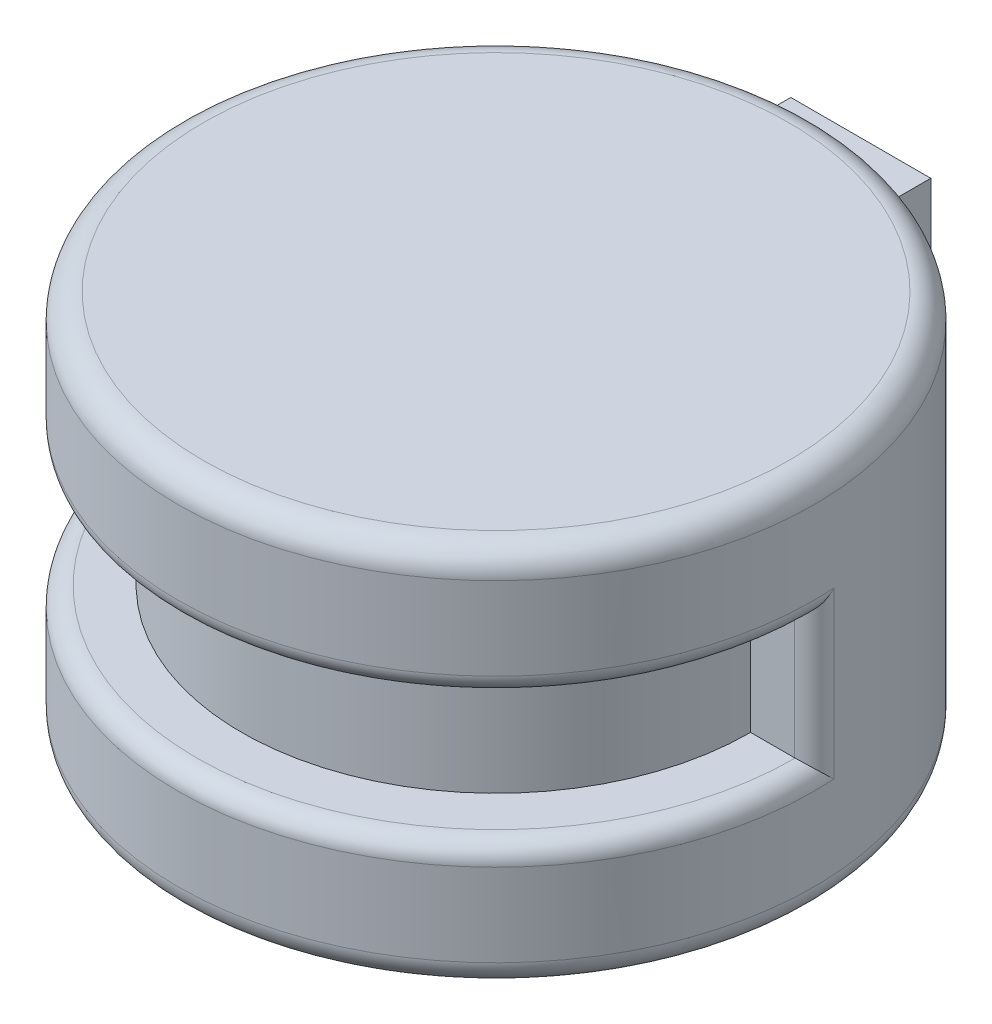
ISO-10303-21;
HEADER;
FILE_DESCRIPTION(('STEP AP214'),'2;1');
FILE_NAME('part.step','',(''),(''),'','','');
FILE_SCHEMA(('AUTOMOTIVE_DESIGN { 1 0 10303 214 1 1 1 1 }'));
ENDSEC;
DATA;
#1=APPLICATION_CONTEXT('core data for automotive mechanical design processes');
#2=APPLICATION_PROTOCOL_DEFINITION('international standard','automotive_design',2000,#1);
#3=PRODUCT_CONTEXT('',#1,'mechanical');
#4=PRODUCT('Part','Part','',(#3));
#5=PRODUCT_RELATED_PRODUCT_CATEGORY('part','',(#4));
#6=PRODUCT_DEFINITION_FORMATION('','',#4);
#7=PRODUCT_DEFINITION_CONTEXT('part definition',#1,'design');
#8=PRODUCT_DEFINITION('design','',#6,#7);
#9=PRODUCT_DEFINITION_SHAPE('','',#8);
#10=(LENGTH_UNIT() NAMED_UNIT(*) SI_UNIT(.MILLI.,.METRE.));
#11=(NAMED_UNIT(*) PLANE_ANGLE_UNIT() SI_UNIT($,.RADIAN.));
#12=(NAMED_UNIT(*) SI_UNIT($,.STERADIAN.) SOLID_ANGLE_UNIT());
#13=UNCERTAINTY_MEASURE_WITH_UNIT(LENGTH_MEASURE(1.E-05),#10,'distance_accuracy_value','');
#14=(GEOMETRIC_REPRESENTATION_CONTEXT(3) GLOBAL_UNCERTAINTY_ASSIGNED_CONTEXT((#13)) GLOBAL_UNIT_ASSIGNED_CONTEXT((#10,
#11,#12)) REPRESENTATION_CONTEXT('',''));
#15=CARTESIAN_POINT('',(0.,0.,0.));
#16=DIRECTION('',(0.,0.,1.));
#17=DIRECTION('',(1.,0.,0.));
#18=AXIS2_PLACEMENT_3D('',#15,#16,#17);
#19=CARTESIAN_POINT('',(0.00144141468197306,-38.9399020394753,-1.53515637649188));
#20=DIRECTION('',(0.,1.,0.));
#21=DIRECTION('',(0.,0.,1.));
#22=AXIS2_PLACEMENT_3D('',#19,#20,#21);
#23=CYLINDRICAL_SURFACE('',#22,15.);
#24=DIRECTION('',(0.,1.,0.));
#25=VECTOR('',#24,1.);
#26=CARTESIAN_POINT('',(-14.9679705847545,-38.9399020394753,-2.49260318500251));
#27=LINE('',#26,#25);
#28=CARTESIAN_POINT('',(-14.9679705847545,-33.8399020394754,-2.49260318500251));
#29=VERTEX_POINT('',#28);
#30=CARTESIAN_POINT('',(-14.9679705847545,-26.0399020394754,-2.49260318500251));
#31=VERTEX_POINT('',#30);
#32=EDGE_CURVE('E199',#29,#31,#27,.T.);
#33=ORIENTED_EDGE('',*,*,#32,.T.);
#34=CARTESIAN_POINT('',(0.00144141468197306,-26.0399020394754,-1.53515637649188));
#35=DIRECTION('',(0.,1.,0.));
#36=DIRECTION('',(0.,0.,1.));
#37=AXIS2_PLACEMENT_3D('',#34,#35,#36);
#38=CIRCLE('',#37,15.);
#39=CARTESIAN_POINT('',(14.9708534141184,-26.0399020394754,-2.49260318500251));
#40=VERTEX_POINT('',#39);
#41=EDGE_CURVE('E202',#31,#40,#38,.T.);
#42=ORIENTED_EDGE('',*,*,#41,.T.);
#43=DIRECTION('',(0.,1.,0.));
#44=VECTOR('',#43,1.);
#45=CARTESIAN_POINT('',(14.9708534141184,-38.9399020394753,-2.49260318500251));
#46=LINE('',#45,#44);
#47=CARTESIAN_POINT('',(14.9708534141184,-33.8399020394754,-2.49260318500251));
#48=VERTEX_POINT('',#47);
#49=EDGE_CURVE('E197',#40,#48,#46,.F.);
#50=ORIENTED_EDGE('',*,*,#49,.T.);
#51=CARTESIAN_POINT('',(0.00144141468197306,-33.8399020394754,-1.53515637649188));
#52=DIRECTION('',(0.,1.,0.));
#53=DIRECTION('',(0.,0.,1.));
#54=AXIS2_PLACEMENT_3D('',#51,#52,#53);
#55=CIRCLE('',#54,15.);
#56=EDGE_CURVE('E195',#48,#29,#55,.F.);
#57=ORIENTED_EDGE('',*,*,#56,.T.);
#58=EDGE_LOOP('',(#33,#42,#50,#57));
#59=FACE_BOUND('',#58,.T.);
#60=CARTESIAN_POINT('',(0.00144141468197306,-22.1399020394753,-1.53515637649188));
#61=DIRECTION('',(0.,1.,0.));
#62=DIRECTION('',(0.,0.,1.));
#63=AXIS2_PLACEMENT_3D('',#60,#61,#62);
#64=CIRCLE('',#63,15.);
#65=CARTESIAN_POINT('',(0.00144141468197306,-22.1399020394753,13.4648436235081));
#66=VERTEX_POINT('',#65);
#67=EDGE_CURVE('E189',#66,#66,#64,.F.);
#68=ORIENTED_EDGE('',*,*,#67,.T.);
#69=EDGE_LOOP('',(#68));
#70=FACE_BOUND('',#69,.T.);
#71=CARTESIAN_POINT('',(0.00144141468197306,-37.7399020394753,-1.53515637649188));
#72=DIRECTION('',(0.,1.,0.));
#73=DIRECTION('',(0.,0.,1.));
#74=AXIS2_PLACEMENT_3D('',#71,#72,#73);
#75=CIRCLE('',#74,15.);
#76=CARTESIAN_POINT('',(0.00144141468197306,-37.7399020394753,13.4648436235081));
#77=VERTEX_POINT('',#76);
#78=EDGE_CURVE('E186',#77,#77,#75,.T.);
#79=ORIENTED_EDGE('',*,*,#78,.T.);
#80=EDGE_LOOP('',(#79));
#81=FACE_BOUND('',#80,.T.);
#82=CARTESIAN_POINT('',(0.00144141468197306,-23.1662413151324,-1.53515637649188));
#83=DIRECTION('',(0.,-1.,0.));
#84=DIRECTION('',(0.,0.,-1.));
#85=AXIS2_PLACEMENT_3D('',#82,#83,#84);
#86=CIRCLE('',#85,15.);
#87=CARTESIAN_POINT('',(3.39590080940108,-23.1662413151324,-16.1460305946077));
#88=VERTEX_POINT('',#87);
#89=CARTESIAN_POINT('',(-3.20409919059891,-23.1662413151324,-16.1886375133377));
#90=VERTEX_POINT('',#89);
#91=EDGE_CURVE('E134',#88,#90,#86,.F.);
#92=ORIENTED_EDGE('',*,*,#91,.T.);
#93=DIRECTION('',(0.,1.,0.));
#94=VECTOR('',#93,1.);
#95=CARTESIAN_POINT('',(-3.20409919059891,-38.9399020394753,-16.1886375133377));
#96=LINE('',#95,#94);
#97=CARTESIAN_POINT('',(-3.20409919059891,-27.9662413151324,-16.1886375133377));
#98=VERTEX_POINT('',#97);
#99=EDGE_CURVE('E11',#90,#98,#96,.F.);
#100=ORIENTED_EDGE('',*,*,#99,.T.);
#101=CARTESIAN_POINT('',(0.00144141468197306,-27.9662413151324,-1.53515637649188));
#102=DIRECTION('',(0.,1.,0.));
#103=DIRECTION('',(0.,0.,1.));
#104=AXIS2_PLACEMENT_3D('',#101,#102,#103);
#105=CIRCLE('',#104,15.);
#106=CARTESIAN_POINT('',(3.39590080940108,-27.9662413151324,-16.1460305946077));
#107=VERTEX_POINT('',#106);
#108=EDGE_CURVE('E221',#98,#107,#105,.F.);
#109=ORIENTED_EDGE('',*,*,#108,.T.);
#110=DIRECTION('',(0.,1.,0.));
#111=VECTOR('',#110,1.);
#112=CARTESIAN_POINT('',(3.39590080940108,-38.9399020394753,-16.1460305946077));
#113=LINE('',#112,#111);
#114=EDGE_CURVE('E48',#107,#88,#113,.T.);
#115=ORIENTED_EDGE('',*,*,#114,.T.);
#116=EDGE_LOOP('',(#92,#100,#109,#115));
#117=FACE_BOUND('',#116,.T.);
#118=ADVANCED_FACE('F39',(#59,#70,#81,#117),#23,.T.);
#119=CARTESIAN_POINT('',(0.00144141468197306,-38.9399020394753,-1.53515637649188));
#120=DIRECTION('',(0.,0.,-1.));
#121=DIRECTION('',(-1.,0.,0.));
#122=AXIS2_PLACEMENT_3D('',#119,#120,#121);
#123=PLANE('',#122);
#124=DIRECTION('',(-1.,0.,0.));
#125=VECTOR('',#124,1.);
#126=CARTESIAN_POINT('',(0.00144141468197306,-26.9399020394754,-1.53515637649188));
#127=LINE('',#126,#125);
#128=CARTESIAN_POINT('',(-11.998558585318,-26.9399020394754,-1.53515637649188));
#129=VERTEX_POINT('',#128);
#130=CARTESIAN_POINT('',(-14.0698058647883,-26.9399020394754,-1.53515637649188));
#131=VERTEX_POINT('',#130);
#132=EDGE_CURVE('E173',#129,#131,#127,.T.);
#133=ORIENTED_EDGE('',*,*,#132,.T.);
#134=DIRECTION('',(0.,-1.,0.));
#135=VECTOR('',#134,1.);
#136=CARTESIAN_POINT('',(-14.0698058647883,-32.9399020394754,-1.53515637649188));
#137=LINE('',#136,#135);
#138=CARTESIAN_POINT('',(-14.0698058647883,-32.9399020394754,-1.53515637649188));
#139=VERTEX_POINT('',#138);
#140=EDGE_CURVE('E204',#131,#139,#137,.T.);
#141=ORIENTED_EDGE('',*,*,#140,.T.);
#142=DIRECTION('',(-1.,0.,0.));
#143=VECTOR('',#142,1.);
#144=CARTESIAN_POINT('',(0.00144141468197306,-32.9399020394754,-1.53515637649188));
#145=LINE('',#144,#143);
#146=CARTESIAN_POINT('',(-11.998558585318,-32.9399020394754,-1.53515637649188));
#147=VERTEX_POINT('',#146);
#148=EDGE_CURVE('E163',#147,#139,#145,.T.);
#149=ORIENTED_EDGE('',*,*,#148,.F.);
#150=DIRECTION('',(0.,1.,0.));
#151=VECTOR('',#150,1.);
#152=CARTESIAN_POINT('',(-11.998558585318,-38.9399020394753,-1.53515637649188));
#153=LINE('',#152,#151);
#154=EDGE_CURVE('E179',#147,#129,#153,.T.);
#155=ORIENTED_EDGE('',*,*,#154,.T.);
#156=EDGE_LOOP('',(#133,#141,#149,#155));
#157=FACE_BOUND('',#156,.T.);
#158=ADVANCED_FACE('F279',(#157),#123,.F.);
#159=CARTESIAN_POINT('',(0.00144141468197306,-38.9399020394753,-1.53515637649188));
#160=DIRECTION('',(0.,0.,1.));
#161=DIRECTION('',(1.,0.,0.));
#162=AXIS2_PLACEMENT_3D('',#159,#160,#161);
#163=PLANE('',#162);
#164=DIRECTION('',(1.,0.,0.));
#165=VECTOR('',#164,1.);
#166=CARTESIAN_POINT('',(0.00144141468197306,-32.9399020394754,-1.53515637649188));
#167=LINE('',#166,#165);
#168=CARTESIAN_POINT('',(12.001441414682,-32.9399020394754,-1.53515637649188));
#169=VERTEX_POINT('',#168);
#170=CARTESIAN_POINT('',(14.0726886941523,-32.9399020394754,-1.53515637649188));
#171=VERTEX_POINT('',#170);
#172=EDGE_CURVE('E167',#169,#171,#167,.T.);
#173=ORIENTED_EDGE('',*,*,#172,.T.);
#174=DIRECTION('',(0.,1.,0.));
#175=VECTOR('',#174,1.);
#176=CARTESIAN_POINT('',(14.0726886941523,-38.9399020394753,-1.53515637649188));
#177=LINE('',#176,#175);
#178=CARTESIAN_POINT('',(14.0726886941523,-26.9399020394754,-1.53515637649188));
#179=VERTEX_POINT('',#178);
#180=EDGE_CURVE('E207',#171,#179,#177,.T.);
#181=ORIENTED_EDGE('',*,*,#180,.T.);
#182=DIRECTION('',(1.,0.,0.));
#183=VECTOR('',#182,1.);
#184=CARTESIAN_POINT('',(0.00144141468197306,-26.9399020394754,-1.53515637649188));
#185=LINE('',#184,#183);
#186=CARTESIAN_POINT('',(12.001441414682,-26.9399020394754,-1.53515637649188));
#187=VERTEX_POINT('',#186);
#188=EDGE_CURVE('E176',#187,#179,#185,.T.);
#189=ORIENTED_EDGE('',*,*,#188,.F.);
#190=DIRECTION('',(0.,1.,0.));
#191=VECTOR('',#190,1.);
#192=CARTESIAN_POINT('',(12.001441414682,-38.9399020394753,-1.53515637649188));
#193=LINE('',#192,#191);
#194=EDGE_CURVE('E180',#169,#187,#193,.T.);
#195=ORIENTED_EDGE('',*,*,#194,.F.);
#196=EDGE_LOOP('',(#173,#181,#189,#195));
#197=FACE_BOUND('',#196,.T.);
#198=ADVANCED_FACE('F285',(#197),#163,.T.);
#199=CARTESIAN_POINT('',(0.00144141468197306,-38.9399020394753,-1.53515637649188));
#200=DIRECTION('',(0.,1.,0.));
#201=DIRECTION('',(0.,0.,1.));
#202=AXIS2_PLACEMENT_3D('',#199,#200,#201);
#203=CYLINDRICAL_SURFACE('',#202,12.);
#204=CARTESIAN_POINT('',(0.00144141468197306,-32.9399020394754,-1.53515637649188));
#205=DIRECTION('',(0.,1.,0.));
#206=DIRECTION('',(0.,0.,1.));
#207=AXIS2_PLACEMENT_3D('',#204,#205,#206);
#208=CIRCLE('',#207,12.);
#209=EDGE_CURVE('E160',#147,#169,#208,.T.);
#210=ORIENTED_EDGE('',*,*,#209,.T.);
#211=ORIENTED_EDGE('',*,*,#194,.T.);
#212=CARTESIAN_POINT('',(0.00144141468197306,-26.9399020394754,-1.53515637649188));
#213=DIRECTION('',(0.,1.,0.));
#214=DIRECTION('',(0.,0.,1.));
#215=AXIS2_PLACEMENT_3D('',#212,#213,#214);
#216=CIRCLE('',#215,12.);
#217=EDGE_CURVE('E170',#129,#187,#216,.T.);
#218=ORIENTED_EDGE('',*,*,#217,.F.);
#219=ORIENTED_EDGE('',*,*,#154,.F.);
#220=EDGE_LOOP('',(#210,#211,#218,#219));
#221=FACE_BOUND('',#220,.T.);
#222=ADVANCED_FACE('F295',(#221),#203,.T.);
#223=CARTESIAN_POINT('',(0.00144141468197306,-38.9399020394753,-1.53515637649188));
#224=DIRECTION('',(0.,1.,0.));
#225=DIRECTION('',(0.,0.,1.));
#226=AXIS2_PLACEMENT_3D('',#223,#224,#225);
#227=PLANE('',#226);
#228=CARTESIAN_POINT('',(0.00144141468197306,-38.9399020394753,-1.53515637649188));
#229=DIRECTION('',(0.,1.,0.));
#230=DIRECTION('',(0.,0.,1.));
#231=AXIS2_PLACEMENT_3D('',#228,#229,#230);
#232=CIRCLE('',#231,13.8);
#233=CARTESIAN_POINT('',(0.00144141468197306,-38.9399020394753,12.2648436235081));
#234=VERTEX_POINT('',#233);
#235=EDGE_CURVE('E192',#234,#234,#232,.F.);
#236=ORIENTED_EDGE('',*,*,#235,.T.);
#237=EDGE_LOOP('',(#236));
#238=FACE_BOUND('',#237,.T.);
#239=ADVANCED_FACE('F298',(#238),#227,.F.);
#240=CARTESIAN_POINT('',(0.00144141468197306,-20.9399020394753,-1.53515637649188));
#241=DIRECTION('',(0.,1.,0.));
#242=DIRECTION('',(0.,0.,1.));
#243=AXIS2_PLACEMENT_3D('',#240,#241,#242);
#244=PLANE('',#243);
#245=CARTESIAN_POINT('',(0.00144141468197306,-20.9399020394753,-1.53515637649188));
#246=DIRECTION('',(0.,1.,0.));
#247=DIRECTION('',(0.,0.,1.));
#248=AXIS2_PLACEMENT_3D('',#245,#246,#247);
#249=CIRCLE('',#248,13.8);
#250=CARTESIAN_POINT('',(0.00144141468197306,-20.9399020394753,12.2648436235081));
#251=VERTEX_POINT('',#250);
#252=EDGE_CURVE('E182',#251,#251,#249,.T.);
#253=ORIENTED_EDGE('',*,*,#252,.T.);
#254=EDGE_LOOP('',(#253));
#255=FACE_BOUND('',#254,.T.);
#256=ADVANCED_FACE('F291',(#255),#244,.T.);
#257=CARTESIAN_POINT('',(0.00144141468197306,-26.9399020394754,-1.53515637649188));
#258=DIRECTION('',(0.,1.,0.));
#259=DIRECTION('',(0.,0.,1.));
#260=AXIS2_PLACEMENT_3D('',#257,#258,#259);
#261=PLANE('',#260);
#262=CARTESIAN_POINT('',(14.0726886941523,-26.9399020394754,-2.43515637649188));
#263=DIRECTION('',(0.,1.,0.));
#264=DIRECTION('',(0.,0.,1.));
#265=AXIS2_PLACEMENT_3D('',#262,#263,#264);
#266=CIRCLE('',#265,0.9);
#267=CARTESIAN_POINT('',(14.1014414071978,-26.9399020394754,-1.53561578180339));
#268=VERTEX_POINT('',#267);
#269=EDGE_CURVE('E216',#179,#268,#266,.T.);
#270=ORIENTED_EDGE('',*,*,#269,.T.);
#271=CARTESIAN_POINT('',(0.00144141468197306,-26.9399020394754,-1.53515637649188));
#272=DIRECTION('',(0.,1.,0.));
#273=DIRECTION('',(0.,0.,1.));
#274=AXIS2_PLACEMENT_3D('',#271,#272,#273);
#275=CIRCLE('',#274,14.1);
#276=CARTESIAN_POINT('',(-14.0985585778339,-26.9399020394754,-1.53561578180339));
#277=VERTEX_POINT('',#276);
#278=EDGE_CURVE('E209',#268,#277,#275,.F.);
#279=ORIENTED_EDGE('',*,*,#278,.T.);
#280=CARTESIAN_POINT('',(-14.0698058647883,-26.9399020394754,-2.43515637649188));
#281=DIRECTION('',(0.,1.,0.));
#282=DIRECTION('',(0.,0.,1.));
#283=AXIS2_PLACEMENT_3D('',#280,#281,#282);
#284=CIRCLE('',#283,0.9);
#285=EDGE_CURVE('E212',#277,#131,#284,.T.);
#286=ORIENTED_EDGE('',*,*,#285,.T.);
#287=ORIENTED_EDGE('',*,*,#132,.F.);
#288=ORIENTED_EDGE('',*,*,#217,.T.);
#289=ORIENTED_EDGE('',*,*,#188,.T.);
#290=EDGE_LOOP('',(#270,#279,#286,#287,#288,#289));
#291=FACE_BOUND('',#290,.T.);
#292=ADVANCED_FACE('F321',(#291),#261,.F.);
#293=CARTESIAN_POINT('',(0.00144141468197306,-32.9399020394754,-1.53515637649188));
#294=DIRECTION('',(0.,1.,0.));
#295=DIRECTION('',(0.,0.,1.));
#296=AXIS2_PLACEMENT_3D('',#293,#294,#295);
#297=PLANE('',#296);
#298=CARTESIAN_POINT('',(-14.0698058647883,-32.9399020394754,-2.43515637649188));
#299=DIRECTION('',(0.,1.,0.));
#300=DIRECTION('',(0.,0.,1.));
#301=AXIS2_PLACEMENT_3D('',#298,#299,#300);
#302=CIRCLE('',#301,0.9);
#303=CARTESIAN_POINT('',(-14.0985585778339,-32.9399020394754,-1.53561578180339));
#304=VERTEX_POINT('',#303);
#305=EDGE_CURVE('E214',#139,#304,#302,.F.);
#306=ORIENTED_EDGE('',*,*,#305,.T.);
#307=CARTESIAN_POINT('',(0.00144141468197306,-32.9399020394754,-1.53515637649188));
#308=DIRECTION('',(0.,1.,0.));
#309=DIRECTION('',(0.,0.,1.));
#310=AXIS2_PLACEMENT_3D('',#307,#308,#309);
#311=CIRCLE('',#310,14.1);
#312=CARTESIAN_POINT('',(14.1014414071978,-32.9399020394754,-1.53561578180339));
#313=VERTEX_POINT('',#312);
#314=EDGE_CURVE('E63',#304,#313,#311,.T.);
#315=ORIENTED_EDGE('',*,*,#314,.T.);
#316=CARTESIAN_POINT('',(14.0726886941523,-32.9399020394754,-2.43515637649188));
#317=DIRECTION('',(0.,1.,0.));
#318=DIRECTION('',(0.,0.,1.));
#319=AXIS2_PLACEMENT_3D('',#316,#317,#318);
#320=CIRCLE('',#319,0.9);
#321=EDGE_CURVE('E219',#313,#171,#320,.F.);
#322=ORIENTED_EDGE('',*,*,#321,.T.);
#323=ORIENTED_EDGE('',*,*,#172,.F.);
#324=ORIENTED_EDGE('',*,*,#209,.F.);
#325=ORIENTED_EDGE('',*,*,#148,.T.);
#326=EDGE_LOOP('',(#306,#315,#322,#323,#324,#325));
#327=FACE_BOUND('',#326,.T.);
#328=ADVANCED_FACE('F304',(#327),#297,.T.);
#329=CARTESIAN_POINT('',(0.00144141468197306,-22.1399020394753,-1.53515637649188));
#330=DIRECTION('',(0.,1.,0.));
#331=DIRECTION('',(0.,0.,1.));
#332=AXIS2_PLACEMENT_3D('',#329,#330,#331);
#333=TOROIDAL_SURFACE('',#332,13.8,1.2);
#334=ORIENTED_EDGE('',*,*,#67,.F.);
#335=EDGE_LOOP('',(#334));
#336=FACE_BOUND('',#335,.T.);
#337=ORIENTED_EDGE('',*,*,#252,.F.);
#338=EDGE_LOOP('',(#337));
#339=FACE_BOUND('',#338,.T.);
#340=ADVANCED_FACE('F301',(#336,#339),#333,.T.);
#341=CARTESIAN_POINT('',(0.00144141468197306,-37.7399020394753,-1.53515637649188));
#342=DIRECTION('',(0.,1.,0.));
#343=DIRECTION('',(0.,0.,1.));
#344=AXIS2_PLACEMENT_3D('',#341,#342,#343);
#345=TOROIDAL_SURFACE('',#344,13.8,1.2);
#346=ORIENTED_EDGE('',*,*,#235,.F.);
#347=EDGE_LOOP('',(#346));
#348=FACE_BOUND('',#347,.T.);
#349=ORIENTED_EDGE('',*,*,#78,.F.);
#350=EDGE_LOOP('',(#349));
#351=FACE_BOUND('',#350,.T.);
#352=ADVANCED_FACE('F303',(#348,#351),#345,.T.);
#353=CARTESIAN_POINT('',(14.0726886941523,-38.9399020394753,-2.43515637649188));
#354=DIRECTION('',(0.,1.,0.));
#355=DIRECTION('',(0.,0.,1.));
#356=AXIS2_PLACEMENT_3D('',#353,#354,#355);
#357=CYLINDRICAL_SURFACE('',#356,0.9);
#358=ORIENTED_EDGE('',*,*,#180,.F.);
#359=ORIENTED_EDGE('',*,*,#321,.F.);
#360=CARTESIAN_POINT('',(14.1014414071978,-32.9399020394754,-1.53561578180339));
#361=CARTESIAN_POINT('',(14.1217665242814,-32.939899309163,-1.53626266853472));
#362=CARTESIAN_POINT('',(14.142056291882,-32.9405911159312,-1.53760413706289));
#363=CARTESIAN_POINT('',(14.1823927569909,-32.9433228456798,-1.54163817010168));
#364=CARTESIAN_POINT('',(14.2024396444154,-32.9453616354062,-1.54432959839591));
#365=CARTESIAN_POINT('',(14.2616346357855,-32.9533881532963,-1.5543120819713));
#366=CARTESIAN_POINT('',(14.3002258916542,-32.9612877312306,-1.56352515145563));
#367=CARTESIAN_POINT('',(14.3746284610689,-32.9815251395365,-1.58642306879157));
#368=CARTESIAN_POINT('',(14.4104477490414,-32.9938496158738,-1.60009445050316));
#369=CARTESIAN_POINT('',(14.4789286602448,-33.0221904455588,-1.63117422950876));
#370=CARTESIAN_POINT('',(14.5115827048816,-33.0382153633399,-1.64859128940973));
#371=CARTESIAN_POINT('',(14.5859344723577,-33.0803205443556,-1.69409381410571));
#372=CARTESIAN_POINT('',(14.6259211920218,-33.1078417649762,-1.72363965811601));
#373=CARTESIAN_POINT('',(14.6988858179729,-33.167021043147,-1.78691363224917));
#374=CARTESIAN_POINT('',(14.7318511897331,-33.1986863387407,-1.82064907453724));
#375=CARTESIAN_POINT('',(14.801677558347,-33.2768230122074,-1.90366695380436));
#376=CARTESIAN_POINT('',(14.8356866619065,-33.324527991601,-1.95418210894162));
#377=CARTESIAN_POINT('',(14.8921535975533,-33.4232086219552,-2.05833621880371));
#378=CARTESIAN_POINT('',(14.9145962977802,-33.4741884597732,-2.11197916393836));
#379=CARTESIAN_POINT('',(14.9482882280865,-33.5769015900474,-2.21965861264778));
#380=CARTESIAN_POINT('',(14.9597645518844,-33.6285960313746,-2.27366269506308));
#381=CARTESIAN_POINT('',(14.9727635832039,-33.7327279706463,-2.3819590340202));
#382=CARTESIAN_POINT('',(14.9743081329729,-33.7851635836811,-2.43625039520783));
#383=CARTESIAN_POINT('',(14.9709558748281,-33.8383290851831,-2.49098404482534));
#384=CARTESIAN_POINT('',(14.9709051907427,-33.8391155695294,-2.49179365729793));
#385=CARTESIAN_POINT('',(14.9708534141184,-33.8399020394754,-2.49260318500251));
#386=B_SPLINE_CURVE_WITH_KNOTS('',3,(#360,#361,#362,#363,#364,#365,#366,#367,#368,#369,#370,
#371,#372,#373,#374,#375,#376,#377,#378,#379,#380,#381,#382,#383,#384,#385),.UNSPECIFIED.,.F.,
.F.,(4,2,2,2,2,2,2,2,2,2,2,2,4),(0.,0.0609581237158232,0.12186502687807,0.24253002713868,
0.362833888349112,0.483419026395125,0.652962934312755,0.822807021554353,1.05364070323297,
1.28477561360225,1.51101319902529,1.73675306548328,1.74014266317733),.UNSPECIFIED.);
#387=EDGE_CURVE('E164',#48,#313,#386,.F.);
#388=ORIENTED_EDGE('',*,*,#387,.F.);
#389=ORIENTED_EDGE('',*,*,#49,.F.);
#390=CARTESIAN_POINT('',(14.1014414071978,-26.9399020394754,-1.53561578180339));
#391=CARTESIAN_POINT('',(14.1217665242814,-26.9399047697877,-1.53626266853472));
#392=CARTESIAN_POINT('',(14.142056291882,-26.9392129630195,-1.53760413706289));
#393=CARTESIAN_POINT('',(14.1823927569909,-26.9364812332709,-1.54163817010168));
#394=CARTESIAN_POINT('',(14.2024396444154,-26.9344424435445,-1.54432959839591));
#395=CARTESIAN_POINT('',(14.2616346357855,-26.9264159256544,-1.5543120819713));
#396=CARTESIAN_POINT('',(14.3002258916542,-26.9185163477201,-1.56352515145563));
#397=CARTESIAN_POINT('',(14.3746284610689,-26.8982789394142,-1.58642306879157));
#398=CARTESIAN_POINT('',(14.4104477490414,-26.8859544630769,-1.60009445050316));
#399=CARTESIAN_POINT('',(14.4789286602448,-26.8576136333919,-1.63117422950876));
#400=CARTESIAN_POINT('',(14.5115827048816,-26.8415887156109,-1.64859128940974));
#401=CARTESIAN_POINT('',(14.5859344723576,-26.7994835345951,-1.69409381410571));
#402=CARTESIAN_POINT('',(14.6259211920218,-26.7719623139745,-1.72363965811601));
#403=CARTESIAN_POINT('',(14.6988858179729,-26.7127830358037,-1.78691363224917));
#404=CARTESIAN_POINT('',(14.7318511897331,-26.68111774021,-1.82064907453725));
#405=CARTESIAN_POINT('',(14.801677558347,-26.6029810667433,-1.90366695380435));
#406=CARTESIAN_POINT('',(14.8356866619065,-26.5552760873497,-1.95418210894158));
#407=CARTESIAN_POINT('',(14.8921535975533,-26.4565954569955,-2.05833621880376));
#408=CARTESIAN_POINT('',(14.9145962977802,-26.4056156191776,-2.11197916393852));
#409=CARTESIAN_POINT('',(14.9482882280866,-26.3029024889032,-2.21965861264763));
#410=CARTESIAN_POINT('',(14.9597645518845,-26.2512080475755,-2.27366269506249));
#411=CARTESIAN_POINT('',(14.9727635832038,-26.147076108305,-2.38195903402079));
#412=CARTESIAN_POINT('',(14.9743081329727,-26.0946404952719,-2.43625039521003));
#413=CARTESIAN_POINT('',(14.9709558748281,-26.0414749937677,-2.49098404482541));
#414=CARTESIAN_POINT('',(14.9709051907427,-26.0406885094213,-2.49179365729796));
#415=CARTESIAN_POINT('',(14.9708534141184,-26.0399020394754,-2.49260318500251));
#416=B_SPLINE_CURVE_WITH_KNOTS('',3,(#390,#391,#392,#393,#394,#395,#396,#397,#398,#399,#400,
#401,#402,#403,#404,#405,#406,#407,#408,#409,#410,#411,#412,#413,#414,#415),.UNSPECIFIED.,.F.,
.F.,(4,2,2,2,2,2,2,2,2,2,2,2,4),(0.,0.0609581237158233,0.12186502687807,0.24253002713868,
0.362833888349117,0.483419026395125,0.652962934312751,0.82280702155435,1.05364070323298,
1.28477561360226,1.51101319902529,1.73675306548328,1.74014266317733),.UNSPECIFIED.);
#417=EDGE_CURVE('E255',#268,#40,#416,.T.);
#418=ORIENTED_EDGE('',*,*,#417,.F.);
#419=ORIENTED_EDGE('',*,*,#269,.F.);
#420=EDGE_LOOP('',(#358,#359,#388,#389,#418,#419));
#421=FACE_BOUND('',#420,.T.);
#422=ADVANCED_FACE('F41',(#421),#357,.T.);
#423=CARTESIAN_POINT('',(0.00144141468197306,-33.8399020394754,-1.53515637649188));
#424=DIRECTION('',(0.,1.,0.));
#425=DIRECTION('',(0.,0.,1.));
#426=AXIS2_PLACEMENT_3D('',#423,#424,#425);
#427=TOROIDAL_SURFACE('',#426,14.1,0.9);
#428=ORIENTED_EDGE('',*,*,#314,.F.);
#429=CARTESIAN_POINT('',(-14.0985585778339,-32.9399020394754,-1.53561578180339));
#430=CARTESIAN_POINT('',(-14.1188836949175,-32.939899309163,-1.53626266853472));
#431=CARTESIAN_POINT('',(-14.1391734625181,-32.9405911159312,-1.53760413706289));
#432=CARTESIAN_POINT('',(-14.1795099276269,-32.9433228456798,-1.54163817010168));
#433=CARTESIAN_POINT('',(-14.1995568150515,-32.9453616354062,-1.54432959839591));
#434=CARTESIAN_POINT('',(-14.2587518064216,-32.9533881532963,-1.5543120819713));
#435=CARTESIAN_POINT('',(-14.2973430622902,-32.9612877312306,-1.56352515145563));
#436=CARTESIAN_POINT('',(-14.3717456317049,-32.9815251395365,-1.58642306879157));
#437=CARTESIAN_POINT('',(-14.4075649196774,-32.9938496158738,-1.60009445050316));
#438=CARTESIAN_POINT('',(-14.4760458308809,-33.0221904455588,-1.63117422950876));
#439=CARTESIAN_POINT('',(-14.5086998755176,-33.0382153633399,-1.64859128940974));
#440=CARTESIAN_POINT('',(-14.5830516429937,-33.0803205443556,-1.69409381410571));
#441=CARTESIAN_POINT('',(-14.6230383626579,-33.1078417649762,-1.72363965811601));
#442=CARTESIAN_POINT('',(-14.6960029886089,-33.167021043147,-1.78691363224917));
#443=CARTESIAN_POINT('',(-14.7289683603692,-33.1986863387407,-1.82064907453724));
#444=CARTESIAN_POINT('',(-14.7987947289831,-33.2768230122074,-1.90366695380436));
#445=CARTESIAN_POINT('',(-14.8328038325425,-33.324527991601,-1.95418210894162));
#446=CARTESIAN_POINT('',(-14.8892707681894,-33.4232086219552,-2.05833621880371));
#447=CARTESIAN_POINT('',(-14.9117134684163,-33.4741884597733,-2.11197916393836));
#448=CARTESIAN_POINT('',(-14.9454053987226,-33.5769015900474,-2.21965861264778));
#449=CARTESIAN_POINT('',(-14.9568817225205,-33.6285960313746,-2.27366269506309));
#450=CARTESIAN_POINT('',(-14.9698807538399,-33.7327279706463,-2.3819590340202));
#451=CARTESIAN_POINT('',(-14.9714253036089,-33.7851635836811,-2.43625039520782));
#452=CARTESIAN_POINT('',(-14.9680730454642,-33.8383290851831,-2.49098404482534));
#453=CARTESIAN_POINT('',(-14.9680223613787,-33.8391155695294,-2.49179365729793));
#454=CARTESIAN_POINT('',(-14.9679705847545,-33.8399020394754,-2.49260318500251));
#455=B_SPLINE_CURVE_WITH_KNOTS('',3,(#429,#430,#431,#432,#433,#434,#435,#436,#437,#438,#439,
#440,#441,#442,#443,#444,#445,#446,#447,#448,#449,#450,#451,#452,#453,#454),.UNSPECIFIED.,.F.,
.F.,(4,2,2,2,2,2,2,2,2,2,2,2,4),(0.,0.0609581237158232,0.121865026878068,0.242530027138679,
0.362833888349114,0.483419026395125,0.652962934312754,0.822807021554353,1.05364070323298,
1.28477561360225,1.51101319902528,1.73675306548328,1.74014266317733),.UNSPECIFIED.);
#456=EDGE_CURVE('E229',#29,#304,#455,.F.);
#457=ORIENTED_EDGE('',*,*,#456,.F.);
#458=ORIENTED_EDGE('',*,*,#56,.F.);
#459=ORIENTED_EDGE('',*,*,#387,.T.);
#460=EDGE_LOOP('',(#428,#457,#458,#459));
#461=FACE_BOUND('',#460,.T.);
#462=ADVANCED_FACE('F242',(#461),#427,.T.);
#463=CARTESIAN_POINT('',(0.00144141468197306,-26.0399020394754,-1.53515637649188));
#464=DIRECTION('',(0.,1.,0.));
#465=DIRECTION('',(0.,0.,1.));
#466=AXIS2_PLACEMENT_3D('',#463,#464,#465);
#467=TOROIDAL_SURFACE('',#466,14.1,0.9);
#468=ORIENTED_EDGE('',*,*,#417,.T.);
#469=ORIENTED_EDGE('',*,*,#41,.F.);
#470=CARTESIAN_POINT('',(-14.0985585778339,-26.9399020394754,-1.53561578180339));
#471=CARTESIAN_POINT('',(-14.1188836949175,-26.9399047697877,-1.53626266853472));
#472=CARTESIAN_POINT('',(-14.1391734625181,-26.9392129630195,-1.53760413706289));
#473=CARTESIAN_POINT('',(-14.1795099276269,-26.9364812332709,-1.54163817010168));
#474=CARTESIAN_POINT('',(-14.1995568150515,-26.9344424435445,-1.54432959839591));
#475=CARTESIAN_POINT('',(-14.2587518064216,-26.9264159256544,-1.5543120819713));
#476=CARTESIAN_POINT('',(-14.2973430622902,-26.9185163477201,-1.56352515145563));
#477=CARTESIAN_POINT('',(-14.3717456317049,-26.8982789394142,-1.58642306879157));
#478=CARTESIAN_POINT('',(-14.4075649196774,-26.8859544630769,-1.60009445050316));
#479=CARTESIAN_POINT('',(-14.4760458308809,-26.8576136333919,-1.63117422950876));
#480=CARTESIAN_POINT('',(-14.5086998755176,-26.8415887156109,-1.64859128940974));
#481=CARTESIAN_POINT('',(-14.5830516429937,-26.7994835345951,-1.69409381410571));
#482=CARTESIAN_POINT('',(-14.6230383626578,-26.7719623139745,-1.72363965811601));
#483=CARTESIAN_POINT('',(-14.6960029886089,-26.7127830358037,-1.78691363224917));
#484=CARTESIAN_POINT('',(-14.7289683603692,-26.68111774021,-1.82064907453725));
#485=CARTESIAN_POINT('',(-14.7987947289831,-26.6029810667433,-1.90366695380435));
#486=CARTESIAN_POINT('',(-14.8328038325426,-26.5552760873497,-1.95418210894158));
#487=CARTESIAN_POINT('',(-14.8892707681894,-26.4565954569955,-2.05833621880376));
#488=CARTESIAN_POINT('',(-14.9117134684163,-26.4056156191776,-2.11197916393852));
#489=CARTESIAN_POINT('',(-14.9454053987226,-26.3029024889032,-2.21965861264763));
#490=CARTESIAN_POINT('',(-14.9568817225205,-26.2512080475755,-2.2736626950625));
#491=CARTESIAN_POINT('',(-14.9698807538399,-26.147076108305,-2.38195903402079));
#492=CARTESIAN_POINT('',(-14.9714253036088,-26.0946404952719,-2.43625039521003));
#493=CARTESIAN_POINT('',(-14.9680730454642,-26.0414749937677,-2.49098404482541));
#494=CARTESIAN_POINT('',(-14.9680223613787,-26.0406885094213,-2.49179365729796));
#495=CARTESIAN_POINT('',(-14.9679705847545,-26.0399020394754,-2.49260318500251));
#496=B_SPLINE_CURVE_WITH_KNOTS('',3,(#470,#471,#472,#473,#474,#475,#476,#477,#478,#479,#480,
#481,#482,#483,#484,#485,#486,#487,#488,#489,#490,#491,#492,#493,#494,#495),.UNSPECIFIED.,.F.,
.F.,(4,2,2,2,2,2,2,2,2,2,2,2,4),(0.,0.0609581237158233,0.12186502687807,0.242530027138678,
0.362833888349114,0.483419026395125,0.652962934312752,0.82280702155435,1.05364070323298,
1.28477561360226,1.51101319902529,1.73675306548328,1.74014266317733),.UNSPECIFIED.);
#497=EDGE_CURVE('E138',#277,#31,#496,.T.);
#498=ORIENTED_EDGE('',*,*,#497,.F.);
#499=ORIENTED_EDGE('',*,*,#278,.F.);
#500=EDGE_LOOP('',(#468,#469,#498,#499));
#501=FACE_BOUND('',#500,.T.);
#502=ADVANCED_FACE('F235',(#501),#467,.T.);
#503=CARTESIAN_POINT('',(-14.0698058647883,-38.9399020394753,-2.43515637649188));
#504=DIRECTION('',(0.,1.,0.));
#505=DIRECTION('',(0.,0.,1.));
#506=AXIS2_PLACEMENT_3D('',#503,#504,#505);
#507=CYLINDRICAL_SURFACE('',#506,0.9);
#508=ORIENTED_EDGE('',*,*,#305,.F.);
#509=ORIENTED_EDGE('',*,*,#140,.F.);
#510=ORIENTED_EDGE('',*,*,#285,.F.);
#511=ORIENTED_EDGE('',*,*,#497,.T.);
#512=ORIENTED_EDGE('',*,*,#32,.F.);
#513=ORIENTED_EDGE('',*,*,#456,.T.);
#514=EDGE_LOOP('',(#508,#509,#510,#511,#512,#513));
#515=FACE_BOUND('',#514,.T.);
#516=ADVANCED_FACE('F238',(#515),#507,.T.);
#517=CARTESIAN_POINT('',(-3.20409919059891,-23.1662413151324,-15.0351563764919));
#518=DIRECTION('',(0.,-1.,0.));
#519=DIRECTION('',(0.,0.,-1.));
#520=AXIS2_PLACEMENT_3D('',#517,#518,#519);
#521=PLANE('',#520);
#522=DIRECTION('',(0.,0.,-1.));
#523=VECTOR('',#522,1.);
#524=CARTESIAN_POINT('',(-3.20409919059891,-23.1662413151324,-15.0351563764919));
#525=LINE('',#524,#523);
#526=CARTESIAN_POINT('',(-3.20409919059891,-23.1662413151324,-18.6351563764919));
#527=VERTEX_POINT('',#526);
#528=EDGE_CURVE('E139',#90,#527,#525,.T.);
#529=ORIENTED_EDGE('',*,*,#528,.F.);
#530=ORIENTED_EDGE('',*,*,#91,.F.);
#531=DIRECTION('',(0.,0.,-1.));
#532=VECTOR('',#531,1.);
#533=CARTESIAN_POINT('',(3.39590080940108,-23.1662413151324,-15.0351563764919));
#534=LINE('',#533,#532);
#535=CARTESIAN_POINT('',(3.39590080940108,-23.1662413151324,-18.6351563764919));
#536=VERTEX_POINT('',#535);
#537=EDGE_CURVE('E129',#88,#536,#534,.T.);
#538=ORIENTED_EDGE('',*,*,#537,.T.);
#539=DIRECTION('',(-1.,0.,0.));
#540=VECTOR('',#539,1.);
#541=CARTESIAN_POINT('',(-3.20409919059891,-23.1662413151324,-18.6351563764919));
#542=LINE('',#541,#540);
#543=EDGE_CURVE('E133',#536,#527,#542,.T.);
#544=ORIENTED_EDGE('',*,*,#543,.T.);
#545=EDGE_LOOP('',(#529,#530,#538,#544));
#546=FACE_BOUND('',#545,.T.);
#547=ADVANCED_FACE('F132',(#546),#521,.F.);
#548=CARTESIAN_POINT('',(-3.20409919059891,-27.9662413151324,-15.0351563764919));
#549=DIRECTION('',(0.,1.,0.));
#550=DIRECTION('',(0.,0.,1.));
#551=AXIS2_PLACEMENT_3D('',#548,#549,#550);
#552=PLANE('',#551);
#553=ORIENTED_EDGE('',*,*,#108,.F.);
#554=DIRECTION('',(0.,0.,-1.));
#555=VECTOR('',#554,1.);
#556=CARTESIAN_POINT('',(-3.20409919059891,-27.9662413151324,-15.0351563764919));
#557=LINE('',#556,#555);
#558=CARTESIAN_POINT('',(-3.20409919059891,-27.9662413151324,-18.6351563764919));
#559=VERTEX_POINT('',#558);
#560=EDGE_CURVE('E157',#98,#559,#557,.T.);
#561=ORIENTED_EDGE('',*,*,#560,.T.);
#562=DIRECTION('',(1.,0.,0.));
#563=VECTOR('',#562,1.);
#564=CARTESIAN_POINT('',(-3.20409919059891,-27.9662413151324,-18.6351563764919));
#565=LINE('',#564,#563);
#566=CARTESIAN_POINT('',(3.39590080940108,-27.9662413151324,-18.6351563764919));
#567=VERTEX_POINT('',#566);
#568=EDGE_CURVE('E154',#559,#567,#565,.T.);
#569=ORIENTED_EDGE('',*,*,#568,.T.);
#570=DIRECTION('',(0.,0.,-1.));
#571=VECTOR('',#570,1.);
#572=CARTESIAN_POINT('',(3.39590080940108,-27.9662413151324,-15.0351563764919));
#573=LINE('',#572,#571);
#574=EDGE_CURVE('E55',#107,#567,#573,.T.);
#575=ORIENTED_EDGE('',*,*,#574,.F.);
#576=EDGE_LOOP('',(#553,#561,#569,#575));
#577=FACE_BOUND('',#576,.T.);
#578=ADVANCED_FACE('F265',(#577),#552,.F.);
#579=CARTESIAN_POINT('',(3.39590080940108,-27.9662413151324,-15.0351563764919));
#580=DIRECTION('',(-1.,0.,0.));
#581=DIRECTION('',(0.,0.,1.));
#582=AXIS2_PLACEMENT_3D('',#579,#580,#581);
#583=PLANE('',#582);
#584=ORIENTED_EDGE('',*,*,#114,.F.);
#585=ORIENTED_EDGE('',*,*,#574,.T.);
#586=DIRECTION('',(0.,1.,0.));
#587=VECTOR('',#586,1.);
#588=CARTESIAN_POINT('',(3.39590080940108,-27.9662413151324,-18.6351563764919));
#589=LINE('',#588,#587);
#590=EDGE_CURVE('E146',#567,#536,#589,.T.);
#591=ORIENTED_EDGE('',*,*,#590,.T.);
#592=ORIENTED_EDGE('',*,*,#537,.F.);
#593=EDGE_LOOP('',(#584,#585,#591,#592));
#594=FACE_BOUND('',#593,.T.);
#595=ADVANCED_FACE('F150',(#594),#583,.F.);
#596=CARTESIAN_POINT('',(-3.20409919059891,-27.9662413151324,-15.0351563764919));
#597=DIRECTION('',(1.,0.,0.));
#598=DIRECTION('',(0.,0.,-1.));
#599=AXIS2_PLACEMENT_3D('',#596,#597,#598);
#600=PLANE('',#599);
#601=ORIENTED_EDGE('',*,*,#99,.F.);
#602=ORIENTED_EDGE('',*,*,#528,.T.);
#603=DIRECTION('',(0.,-1.,0.));
#604=VECTOR('',#603,1.);
#605=CARTESIAN_POINT('',(-3.20409919059891,-27.9662413151324,-18.6351563764919));
#606=LINE('',#605,#604);
#607=EDGE_CURVE('E148',#527,#559,#606,.T.);
#608=ORIENTED_EDGE('',*,*,#607,.T.);
#609=ORIENTED_EDGE('',*,*,#560,.F.);
#610=EDGE_LOOP('',(#601,#602,#608,#609));
#611=FACE_BOUND('',#610,.T.);
#612=ADVANCED_FACE('F267',(#611),#600,.F.);
#613=CARTESIAN_POINT('',(0.00144141468197306,-20.9399020394753,-18.6351563764919));
#614=DIRECTION('',(0.,0.,-1.));
#615=DIRECTION('',(-1.,0.,0.));
#616=AXIS2_PLACEMENT_3D('',#613,#614,#615);
#617=PLANE('',#616);
#618=ORIENTED_EDGE('',*,*,#590,.F.);
#619=ORIENTED_EDGE('',*,*,#568,.F.);
#620=ORIENTED_EDGE('',*,*,#607,.F.);
#621=ORIENTED_EDGE('',*,*,#543,.F.);
#622=EDGE_LOOP('',(#618,#619,#620,#621));
#623=FACE_BOUND('',#622,.T.);
#624=ADVANCED_FACE('F144',(#623),#617,.T.);
#625=CLOSED_SHELL('',(#118,#158,#198,#222,#239,#256,#292,#328,#340,#352,#422,#462,#502,#516,
#547,#578,#595,#612,#624));
#626=MANIFOLD_SOLID_BREP('B2',#625);
#627=ADVANCED_BREP_SHAPE_REPRESENTATION('',(#18,#626),#14);
#628=SHAPE_DEFINITION_REPRESENTATION(#9,#627);
ENDSEC;
END-ISO-10303-21;
